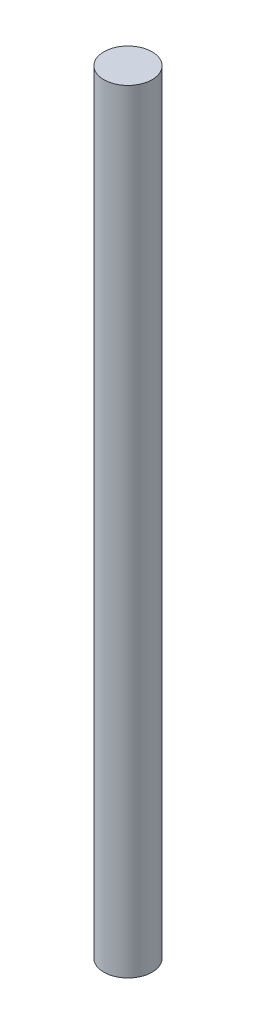
ISO-10303-21;
HEADER;
FILE_DESCRIPTION(('STEP AP214'),'2;1');
FILE_NAME('part.step','',(''),(''),'','','');
FILE_SCHEMA(('AUTOMOTIVE_DESIGN { 1 0 10303 214 1 1 1 1 }'));
ENDSEC;
DATA;
#1=APPLICATION_CONTEXT('core data for automotive mechanical design processes');
#2=APPLICATION_PROTOCOL_DEFINITION('international standard','automotive_design',2000,#1);
#3=PRODUCT_CONTEXT('',#1,'mechanical');
#4=PRODUCT('Part','Part','',(#3));
#5=PRODUCT_RELATED_PRODUCT_CATEGORY('part','',(#4));
#6=PRODUCT_DEFINITION_FORMATION('','',#4);
#7=PRODUCT_DEFINITION_CONTEXT('part definition',#1,'design');
#8=PRODUCT_DEFINITION('design','',#6,#7);
#9=PRODUCT_DEFINITION_SHAPE('','',#8);
#10=(LENGTH_UNIT() NAMED_UNIT(*) SI_UNIT(.MILLI.,.METRE.));
#11=(NAMED_UNIT(*) PLANE_ANGLE_UNIT() SI_UNIT($,.RADIAN.));
#12=(NAMED_UNIT(*) SI_UNIT($,.STERADIAN.) SOLID_ANGLE_UNIT());
#13=UNCERTAINTY_MEASURE_WITH_UNIT(LENGTH_MEASURE(1.E-05),#10,'distance_accuracy_value','');
#14=(GEOMETRIC_REPRESENTATION_CONTEXT(3) GLOBAL_UNCERTAINTY_ASSIGNED_CONTEXT((#13)) GLOBAL_UNIT_ASSIGNED_CONTEXT((#10,
#11,#12)) REPRESENTATION_CONTEXT('',''));
#15=CARTESIAN_POINT('',(0.,0.,0.));
#16=DIRECTION('',(0.,0.,1.));
#17=DIRECTION('',(1.,0.,0.));
#18=AXIS2_PLACEMENT_3D('',#15,#16,#17);
#19=CARTESIAN_POINT('',(0.,76.2,0.));
#20=DIRECTION('',(0.,-1.,0.));
#21=DIRECTION('',(0.,0.,-1.));
#22=AXIS2_PLACEMENT_3D('',#19,#20,#21);
#23=CYLINDRICAL_SURFACE('',#22,2.38125);
#24=CARTESIAN_POINT('',(0.,76.2,0.));
#25=DIRECTION('',(0.,1.,0.));
#26=DIRECTION('',(0.,0.,1.));
#27=AXIS2_PLACEMENT_3D('',#24,#25,#26);
#28=CIRCLE('',#27,2.38125);
#29=CARTESIAN_POINT('',(0.,76.2,2.38125));
#30=VERTEX_POINT('',#29);
#31=EDGE_CURVE('E10',#30,#30,#28,.T.);
#32=ORIENTED_EDGE('',*,*,#31,.F.);
#33=EDGE_LOOP('',(#32));
#34=FACE_BOUND('',#33,.T.);
#35=CARTESIAN_POINT('',(0.,0.,0.));
#36=DIRECTION('',(0.,1.,0.));
#37=DIRECTION('',(0.,0.,1.));
#38=AXIS2_PLACEMENT_3D('',#35,#36,#37);
#39=CIRCLE('',#38,2.38125);
#40=CARTESIAN_POINT('',(0.,0.,2.38125));
#41=VERTEX_POINT('',#40);
#42=EDGE_CURVE('E34',#41,#41,#39,.T.);
#43=ORIENTED_EDGE('',*,*,#42,.T.);
#44=EDGE_LOOP('',(#43));
#45=FACE_BOUND('',#44,.T.);
#46=ADVANCED_FACE('F31',(#34,#45),#23,.T.);
#47=CARTESIAN_POINT('',(0.,76.2,0.));
#48=DIRECTION('',(0.,1.,0.));
#49=DIRECTION('',(0.,0.,1.));
#50=AXIS2_PLACEMENT_3D('',#47,#48,#49);
#51=PLANE('',#50);
#52=ORIENTED_EDGE('',*,*,#31,.T.);
#53=EDGE_LOOP('',(#52));
#54=FACE_BOUND('',#53,.T.);
#55=ADVANCED_FACE('F46',(#54),#51,.T.);
#56=CARTESIAN_POINT('',(0.,0.,0.));
#57=DIRECTION('',(0.,1.,0.));
#58=DIRECTION('',(0.,0.,1.));
#59=AXIS2_PLACEMENT_3D('',#56,#57,#58);
#60=PLANE('',#59);
#61=ORIENTED_EDGE('',*,*,#42,.F.);
#62=EDGE_LOOP('',(#61));
#63=FACE_BOUND('',#62,.T.);
#64=ADVANCED_FACE('F44',(#63),#60,.F.);
#65=CLOSED_SHELL('',(#46,#55,#64));
#66=MANIFOLD_SOLID_BREP('B2',#65);
#67=ADVANCED_BREP_SHAPE_REPRESENTATION('',(#18,#66),#14);
#68=SHAPE_DEFINITION_REPRESENTATION(#9,#67);
ENDSEC;
END-ISO-10303-21;
